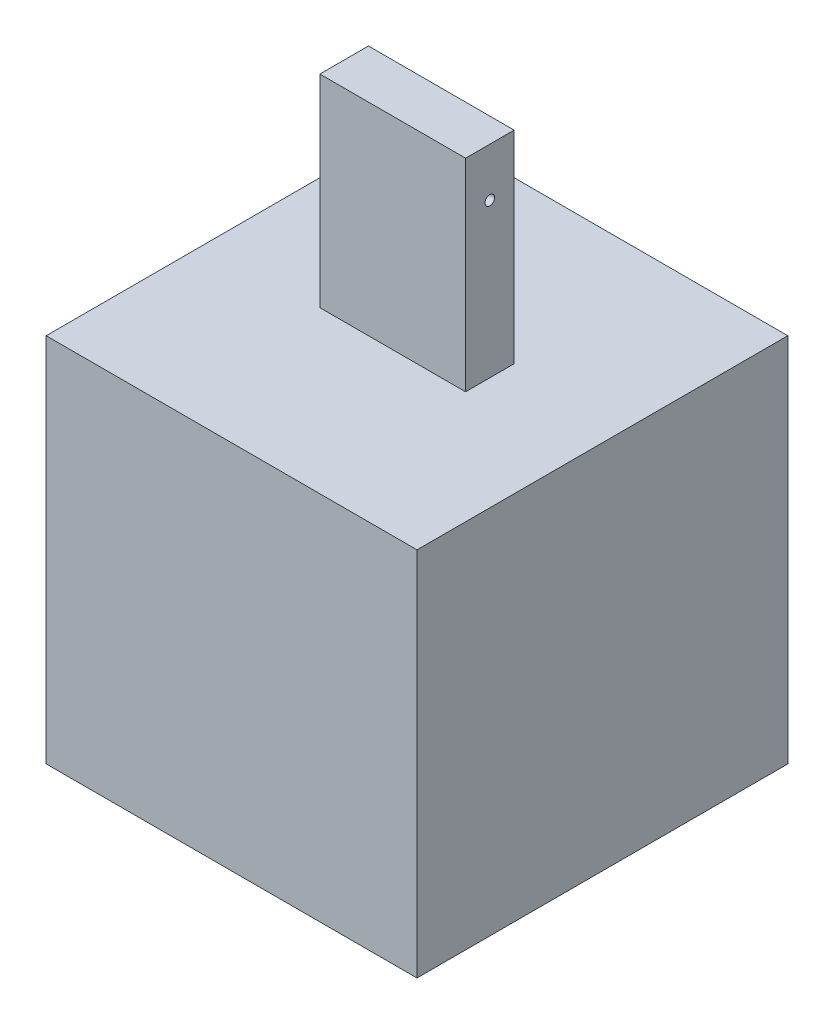
ISO-10303-21;
HEADER;
FILE_DESCRIPTION(('STEP AP214'),'2;1');
FILE_NAME('part.step','',(''),(''),'','','');
FILE_SCHEMA(('AUTOMOTIVE_DESIGN { 1 0 10303 214 1 1 1 1 }'));
ENDSEC;
DATA;
#1=APPLICATION_CONTEXT('core data for automotive mechanical design processes');
#2=APPLICATION_PROTOCOL_DEFINITION('international standard','automotive_design',2000,#1);
#3=PRODUCT_CONTEXT('',#1,'mechanical');
#4=PRODUCT('Part','Part','',(#3));
#5=PRODUCT_RELATED_PRODUCT_CATEGORY('part','',(#4));
#6=PRODUCT_DEFINITION_FORMATION('','',#4);
#7=PRODUCT_DEFINITION_CONTEXT('part definition',#1,'design');
#8=PRODUCT_DEFINITION('design','',#6,#7);
#9=PRODUCT_DEFINITION_SHAPE('','',#8);
#10=(LENGTH_UNIT() NAMED_UNIT(*) SI_UNIT(.MILLI.,.METRE.));
#11=(NAMED_UNIT(*) PLANE_ANGLE_UNIT() SI_UNIT($,.RADIAN.));
#12=(NAMED_UNIT(*) SI_UNIT($,.STERADIAN.) SOLID_ANGLE_UNIT());
#13=UNCERTAINTY_MEASURE_WITH_UNIT(LENGTH_MEASURE(1.E-05),#10,'distance_accuracy_value','');
#14=(GEOMETRIC_REPRESENTATION_CONTEXT(3) GLOBAL_UNCERTAINTY_ASSIGNED_CONTEXT((#13)) GLOBAL_UNIT_ASSIGNED_CONTEXT((#10,
#11,#12)) REPRESENTATION_CONTEXT('',''));
#15=CARTESIAN_POINT('',(0.,0.,0.));
#16=DIRECTION('',(0.,0.,1.));
#17=DIRECTION('',(1.,0.,0.));
#18=AXIS2_PLACEMENT_3D('',#15,#16,#17);
#19=CARTESIAN_POINT('',(319.065,708.13,259.065));
#20=DIRECTION('',(-1.,0.,0.));
#21=DIRECTION('',(0.,-1.,0.));
#22=AXIS2_PLACEMENT_3D('',#19,#20,#21);
#23=PLANE('',#22);
#24=CARTESIAN_POINT('',(319.065,648.13,229.065));
#25=DIRECTION('',(-1.,0.,0.));
#26=DIRECTION('',(0.,-1.,0.));
#27=AXIS2_PLACEMENT_3D('',#24,#25,#26);
#28=CIRCLE('',#27,6.00000000000002);
#29=CARTESIAN_POINT('',(319.065,642.13,229.065));
#30=VERTEX_POINT('',#29);
#31=EDGE_CURVE('E111',#30,#30,#28,.T.);
#32=ORIENTED_EDGE('',*,*,#31,.T.);
#33=EDGE_LOOP('',(#32));
#34=FACE_BOUND('',#33,.T.);
#35=DIRECTION('',(0.,0.,-1.));
#36=VECTOR('',#35,1.);
#37=CARTESIAN_POINT('',(319.065,458.13,259.065));
#38=LINE('',#37,#36);
#39=CARTESIAN_POINT('',(319.065,458.13,259.065));
#40=VERTEX_POINT('',#39);
#41=CARTESIAN_POINT('',(319.065,458.13,199.065));
#42=VERTEX_POINT('',#41);
#43=EDGE_CURVE('E108',#40,#42,#38,.T.);
#44=ORIENTED_EDGE('',*,*,#43,.T.);
#45=DIRECTION('',(0.,-1.,0.));
#46=VECTOR('',#45,1.);
#47=CARTESIAN_POINT('',(319.065,708.13,199.065));
#48=LINE('',#47,#46);
#49=CARTESIAN_POINT('',(319.065,708.13,199.065));
#50=VERTEX_POINT('',#49);
#51=EDGE_CURVE('E12',#50,#42,#48,.T.);
#52=ORIENTED_EDGE('',*,*,#51,.F.);
#53=DIRECTION('',(0.,0.,-1.));
#54=VECTOR('',#53,1.);
#55=CARTESIAN_POINT('',(319.065,708.13,259.065));
#56=LINE('',#55,#54);
#57=CARTESIAN_POINT('',(319.065,708.13,259.065));
#58=VERTEX_POINT('',#57);
#59=EDGE_CURVE('E96',#58,#50,#56,.T.);
#60=ORIENTED_EDGE('',*,*,#59,.F.);
#61=DIRECTION('',(0.,-1.,0.));
#62=VECTOR('',#61,1.);
#63=CARTESIAN_POINT('',(319.065,708.13,259.065));
#64=LINE('',#63,#62);
#65=EDGE_CURVE('E104',#58,#40,#64,.T.);
#66=ORIENTED_EDGE('',*,*,#65,.T.);
#67=EDGE_LOOP('',(#44,#52,#60,#66));
#68=FACE_BOUND('',#67,.T.);
#69=ADVANCED_FACE('F45',(#34,#68),#23,.F.);
#70=CARTESIAN_POINT('',(139.065,708.13,199.065));
#71=DIRECTION('',(0.,0.,1.));
#72=DIRECTION('',(1.,0.,0.));
#73=AXIS2_PLACEMENT_3D('',#70,#71,#72);
#74=PLANE('',#73);
#75=DIRECTION('',(-1.,0.,0.));
#76=VECTOR('',#75,1.);
#77=CARTESIAN_POINT('',(139.065,458.13,199.065));
#78=LINE('',#77,#76);
#79=CARTESIAN_POINT('',(139.065,458.13,199.065));
#80=VERTEX_POINT('',#79);
#81=EDGE_CURVE('E100',#42,#80,#78,.T.);
#82=ORIENTED_EDGE('',*,*,#81,.T.);
#83=DIRECTION('',(0.,-1.,0.));
#84=VECTOR('',#83,1.);
#85=CARTESIAN_POINT('',(139.065,708.13,199.065));
#86=LINE('',#85,#84);
#87=CARTESIAN_POINT('',(139.065,708.13,199.065));
#88=VERTEX_POINT('',#87);
#89=EDGE_CURVE('E53',#88,#80,#86,.T.);
#90=ORIENTED_EDGE('',*,*,#89,.F.);
#91=DIRECTION('',(-1.,0.,0.));
#92=VECTOR('',#91,1.);
#93=CARTESIAN_POINT('',(139.065,708.13,199.065));
#94=LINE('',#93,#92);
#95=EDGE_CURVE('E91',#50,#88,#94,.T.);
#96=ORIENTED_EDGE('',*,*,#95,.F.);
#97=ORIENTED_EDGE('',*,*,#51,.T.);
#98=EDGE_LOOP('',(#82,#90,#96,#97));
#99=FACE_BOUND('',#98,.T.);
#100=ADVANCED_FACE('F99',(#99),#74,.F.);
#101=CARTESIAN_POINT('',(139.065,708.13,259.065));
#102=DIRECTION('',(1.,0.,0.));
#103=DIRECTION('',(0.,1.,0.));
#104=AXIS2_PLACEMENT_3D('',#101,#102,#103);
#105=PLANE('',#104);
#106=CARTESIAN_POINT('',(139.065,648.13,229.065));
#107=DIRECTION('',(-1.,0.,0.));
#108=DIRECTION('',(0.,-1.,0.));
#109=AXIS2_PLACEMENT_3D('',#106,#107,#108);
#110=CIRCLE('',#109,6.00000000000002);
#111=CARTESIAN_POINT('',(139.065,642.13,229.065));
#112=VERTEX_POINT('',#111);
#113=EDGE_CURVE('E124',#112,#112,#110,.T.);
#114=ORIENTED_EDGE('',*,*,#113,.F.);
#115=EDGE_LOOP('',(#114));
#116=FACE_BOUND('',#115,.T.);
#117=DIRECTION('',(0.,0.,1.));
#118=VECTOR('',#117,1.);
#119=CARTESIAN_POINT('',(139.065,458.13,259.065));
#120=LINE('',#119,#118);
#121=CARTESIAN_POINT('',(139.065,458.13,259.065));
#122=VERTEX_POINT('',#121);
#123=EDGE_CURVE('E78',#80,#122,#120,.T.);
#124=ORIENTED_EDGE('',*,*,#123,.T.);
#125=DIRECTION('',(0.,-1.,0.));
#126=VECTOR('',#125,1.);
#127=CARTESIAN_POINT('',(139.065,708.13,259.065));
#128=LINE('',#127,#126);
#129=CARTESIAN_POINT('',(139.065,708.13,259.065));
#130=VERTEX_POINT('',#129);
#131=EDGE_CURVE('E101',#130,#122,#128,.T.);
#132=ORIENTED_EDGE('',*,*,#131,.F.);
#133=DIRECTION('',(0.,0.,1.));
#134=VECTOR('',#133,1.);
#135=CARTESIAN_POINT('',(139.065,708.13,259.065));
#136=LINE('',#135,#134);
#137=EDGE_CURVE('E94',#88,#130,#136,.T.);
#138=ORIENTED_EDGE('',*,*,#137,.F.);
#139=ORIENTED_EDGE('',*,*,#89,.T.);
#140=EDGE_LOOP('',(#124,#132,#138,#139));
#141=FACE_BOUND('',#140,.T.);
#142=ADVANCED_FACE('F102',(#116,#141),#105,.F.);
#143=CARTESIAN_POINT('',(139.065,708.13,259.065));
#144=DIRECTION('',(0.,0.,-1.));
#145=DIRECTION('',(-1.,0.,0.));
#146=AXIS2_PLACEMENT_3D('',#143,#144,#145);
#147=PLANE('',#146);
#148=DIRECTION('',(1.,0.,0.));
#149=VECTOR('',#148,1.);
#150=CARTESIAN_POINT('',(139.065,458.13,259.065));
#151=LINE('',#150,#149);
#152=EDGE_CURVE('E84',#122,#40,#151,.T.);
#153=ORIENTED_EDGE('',*,*,#152,.T.);
#154=ORIENTED_EDGE('',*,*,#65,.F.);
#155=DIRECTION('',(1.,0.,0.));
#156=VECTOR('',#155,1.);
#157=CARTESIAN_POINT('',(139.065,708.13,259.065));
#158=LINE('',#157,#156);
#159=EDGE_CURVE('E61',#130,#58,#158,.T.);
#160=ORIENTED_EDGE('',*,*,#159,.F.);
#161=ORIENTED_EDGE('',*,*,#131,.T.);
#162=EDGE_LOOP('',(#153,#154,#160,#161));
#163=FACE_BOUND('',#162,.T.);
#164=ADVANCED_FACE('F116',(#163),#147,.F.);
#165=CARTESIAN_POINT('',(1.66533453693773E-13,708.13,0.));
#166=DIRECTION('',(0.,-1.,0.));
#167=DIRECTION('',(1.,0.,0.));
#168=AXIS2_PLACEMENT_3D('',#165,#166,#167);
#169=PLANE('',#168);
#170=ORIENTED_EDGE('',*,*,#59,.T.);
#171=ORIENTED_EDGE('',*,*,#95,.T.);
#172=ORIENTED_EDGE('',*,*,#137,.T.);
#173=ORIENTED_EDGE('',*,*,#159,.T.);
#174=EDGE_LOOP('',(#170,#171,#172,#173));
#175=FACE_BOUND('',#174,.T.);
#176=ADVANCED_FACE('F92',(#175),#169,.F.);
#177=CARTESIAN_POINT('',(1.38777878078145E-13,458.13,0.));
#178=DIRECTION('',(0.,-1.,0.));
#179=DIRECTION('',(1.,0.,0.));
#180=AXIS2_PLACEMENT_3D('',#177,#178,#179);
#181=PLANE('',#180);
#182=ORIENTED_EDGE('',*,*,#43,.F.);
#183=ORIENTED_EDGE('',*,*,#152,.F.);
#184=ORIENTED_EDGE('',*,*,#123,.F.);
#185=ORIENTED_EDGE('',*,*,#81,.F.);
#186=EDGE_LOOP('',(#182,#183,#184,#185));
#187=FACE_BOUND('',#186,.T.);
#188=ADVANCED_FACE('F119',(#187),#181,.T.);
#189=CARTESIAN_POINT('',(438.065,648.13,229.065));
#190=DIRECTION('',(-1.,0.,0.));
#191=DIRECTION('',(0.,-1.,0.));
#192=AXIS2_PLACEMENT_3D('',#189,#190,#191);
#193=CYLINDRICAL_SURFACE('',#192,6.00000000000002);
#194=ORIENTED_EDGE('',*,*,#113,.T.);
#195=EDGE_LOOP('',(#194));
#196=FACE_BOUND('',#195,.T.);
#197=ORIENTED_EDGE('',*,*,#31,.F.);
#198=EDGE_LOOP('',(#197));
#199=FACE_BOUND('',#198,.T.);
#200=ADVANCED_FACE('F128',(#196,#199),#193,.F.);
#201=CLOSED_SHELL('',(#69,#100,#142,#164,#176,#188,#200));
#202=MANIFOLD_SOLID_BREP('B2',#201);
#203=CARTESIAN_POINT('',(0.,0.,458.13));
#204=DIRECTION('',(1.,0.,0.));
#205=DIRECTION('',(0.,1.,0.));
#206=AXIS2_PLACEMENT_3D('',#203,#204,#205);
#207=PLANE('',#206);
#208=DIRECTION('',(0.,-1.,0.));
#209=VECTOR('',#208,1.);
#210=CARTESIAN_POINT('',(0.,0.,0.));
#211=LINE('',#210,#209);
#212=CARTESIAN_POINT('',(0.,458.13,0.));
#213=VERTEX_POINT('',#212);
#214=CARTESIAN_POINT('',(0.,0.,0.));
#215=VERTEX_POINT('',#214);
#216=EDGE_CURVE('E239',#213,#215,#211,.T.);
#217=ORIENTED_EDGE('',*,*,#216,.T.);
#218=DIRECTION('',(0.,0.,-1.));
#219=VECTOR('',#218,1.);
#220=CARTESIAN_POINT('',(0.,0.,458.13));
#221=LINE('',#220,#219);
#222=CARTESIAN_POINT('',(0.,0.,458.13));
#223=VERTEX_POINT('',#222);
#224=EDGE_CURVE('E43',#223,#215,#221,.T.);
#225=ORIENTED_EDGE('',*,*,#224,.F.);
#226=DIRECTION('',(0.,-1.,0.));
#227=VECTOR('',#226,1.);
#228=CARTESIAN_POINT('',(0.,0.,458.13));
#229=LINE('',#228,#227);
#230=CARTESIAN_POINT('',(0.,458.13,458.13));
#231=VERTEX_POINT('',#230);
#232=EDGE_CURVE('E227',#231,#223,#229,.T.);
#233=ORIENTED_EDGE('',*,*,#232,.F.);
#234=DIRECTION('',(0.,0.,-1.));
#235=VECTOR('',#234,1.);
#236=CARTESIAN_POINT('',(0.,458.13,458.13));
#237=LINE('',#236,#235);
#238=EDGE_CURVE('E235',#231,#213,#237,.T.);
#239=ORIENTED_EDGE('',*,*,#238,.T.);
#240=EDGE_LOOP('',(#217,#225,#233,#239));
#241=FACE_BOUND('',#240,.T.);
#242=ADVANCED_FACE('F176',(#241),#207,.F.);
#243=CARTESIAN_POINT('',(0.,0.,458.13));
#244=DIRECTION('',(0.,1.,0.));
#245=DIRECTION('',(0.,0.,1.));
#246=AXIS2_PLACEMENT_3D('',#243,#244,#245);
#247=PLANE('',#246);
#248=DIRECTION('',(1.,0.,0.));
#249=VECTOR('',#248,1.);
#250=CARTESIAN_POINT('',(0.,0.,0.));
#251=LINE('',#250,#249);
#252=CARTESIAN_POINT('',(458.13,0.,0.));
#253=VERTEX_POINT('',#252);
#254=EDGE_CURVE('E231',#215,#253,#251,.T.);
#255=ORIENTED_EDGE('',*,*,#254,.T.);
#256=DIRECTION('',(0.,0.,-1.));
#257=VECTOR('',#256,1.);
#258=CARTESIAN_POINT('',(458.13,0.,458.13));
#259=LINE('',#258,#257);
#260=CARTESIAN_POINT('',(458.13,0.,458.13));
#261=VERTEX_POINT('',#260);
#262=EDGE_CURVE('E184',#261,#253,#259,.T.);
#263=ORIENTED_EDGE('',*,*,#262,.F.);
#264=DIRECTION('',(1.,0.,0.));
#265=VECTOR('',#264,1.);
#266=CARTESIAN_POINT('',(0.,0.,458.13));
#267=LINE('',#266,#265);
#268=EDGE_CURVE('E222',#223,#261,#267,.T.);
#269=ORIENTED_EDGE('',*,*,#268,.F.);
#270=ORIENTED_EDGE('',*,*,#224,.T.);
#271=EDGE_LOOP('',(#255,#263,#269,#270));
#272=FACE_BOUND('',#271,.T.);
#273=ADVANCED_FACE('F230',(#272),#247,.F.);
#274=CARTESIAN_POINT('',(458.13,0.,458.13));
#275=DIRECTION('',(-1.,0.,0.));
#276=DIRECTION('',(0.,-1.,0.));
#277=AXIS2_PLACEMENT_3D('',#274,#275,#276);
#278=PLANE('',#277);
#279=DIRECTION('',(0.,1.,0.));
#280=VECTOR('',#279,1.);
#281=CARTESIAN_POINT('',(458.13,0.,0.));
#282=LINE('',#281,#280);
#283=CARTESIAN_POINT('',(458.13,458.13,0.));
#284=VERTEX_POINT('',#283);
#285=EDGE_CURVE('E209',#253,#284,#282,.T.);
#286=ORIENTED_EDGE('',*,*,#285,.T.);
#287=DIRECTION('',(0.,0.,-1.));
#288=VECTOR('',#287,1.);
#289=CARTESIAN_POINT('',(458.13,458.13,458.13));
#290=LINE('',#289,#288);
#291=CARTESIAN_POINT('',(458.13,458.13,458.13));
#292=VERTEX_POINT('',#291);
#293=EDGE_CURVE('E232',#292,#284,#290,.T.);
#294=ORIENTED_EDGE('',*,*,#293,.F.);
#295=DIRECTION('',(0.,1.,0.));
#296=VECTOR('',#295,1.);
#297=CARTESIAN_POINT('',(458.13,0.,458.13));
#298=LINE('',#297,#296);
#299=EDGE_CURVE('E225',#261,#292,#298,.T.);
#300=ORIENTED_EDGE('',*,*,#299,.F.);
#301=ORIENTED_EDGE('',*,*,#262,.T.);
#302=EDGE_LOOP('',(#286,#294,#300,#301));
#303=FACE_BOUND('',#302,.T.);
#304=ADVANCED_FACE('F233',(#303),#278,.F.);
#305=CARTESIAN_POINT('',(0.,458.13,458.13));
#306=DIRECTION('',(0.,-1.,0.));
#307=DIRECTION('',(1.,0.,0.));
#308=AXIS2_PLACEMENT_3D('',#305,#306,#307);
#309=PLANE('',#308);
#310=DIRECTION('',(-1.,0.,0.));
#311=VECTOR('',#310,1.);
#312=CARTESIAN_POINT('',(0.,458.13,0.));
#313=LINE('',#312,#311);
#314=EDGE_CURVE('E215',#284,#213,#313,.T.);
#315=ORIENTED_EDGE('',*,*,#314,.T.);
#316=ORIENTED_EDGE('',*,*,#238,.F.);
#317=DIRECTION('',(-1.,0.,0.));
#318=VECTOR('',#317,1.);
#319=CARTESIAN_POINT('',(0.,458.13,458.13));
#320=LINE('',#319,#318);
#321=EDGE_CURVE('E192',#292,#231,#320,.T.);
#322=ORIENTED_EDGE('',*,*,#321,.F.);
#323=ORIENTED_EDGE('',*,*,#293,.T.);
#324=EDGE_LOOP('',(#315,#316,#322,#323));
#325=FACE_BOUND('',#324,.T.);
#326=ADVANCED_FACE('F246',(#325),#309,.F.);
#327=CARTESIAN_POINT('',(0.,0.,458.13));
#328=DIRECTION('',(0.,0.,-1.));
#329=DIRECTION('',(-1.,0.,0.));
#330=AXIS2_PLACEMENT_3D('',#327,#328,#329);
#331=PLANE('',#330);
#332=ORIENTED_EDGE('',*,*,#232,.T.);
#333=ORIENTED_EDGE('',*,*,#268,.T.);
#334=ORIENTED_EDGE('',*,*,#299,.T.);
#335=ORIENTED_EDGE('',*,*,#321,.T.);
#336=EDGE_LOOP('',(#332,#333,#334,#335));
#337=FACE_BOUND('',#336,.T.);
#338=ADVANCED_FACE('F223',(#337),#331,.F.);
#339=CARTESIAN_POINT('',(0.,0.,0.));
#340=DIRECTION('',(0.,0.,-1.));
#341=DIRECTION('',(-1.,0.,0.));
#342=AXIS2_PLACEMENT_3D('',#339,#340,#341);
#343=PLANE('',#342);
#344=ORIENTED_EDGE('',*,*,#216,.F.);
#345=ORIENTED_EDGE('',*,*,#314,.F.);
#346=ORIENTED_EDGE('',*,*,#285,.F.);
#347=ORIENTED_EDGE('',*,*,#254,.F.);
#348=EDGE_LOOP('',(#344,#345,#346,#347));
#349=FACE_BOUND('',#348,.T.);
#350=ADVANCED_FACE('F249',(#349),#343,.T.);
#351=CLOSED_SHELL('',(#242,#273,#304,#326,#338,#350));
#352=MANIFOLD_SOLID_BREP('B6',#351);
#353=ADVANCED_BREP_SHAPE_REPRESENTATION('',(#18,#202,#352),#14);
#354=SHAPE_DEFINITION_REPRESENTATION(#9,#353);
ENDSEC;
END-ISO-10303-21;
